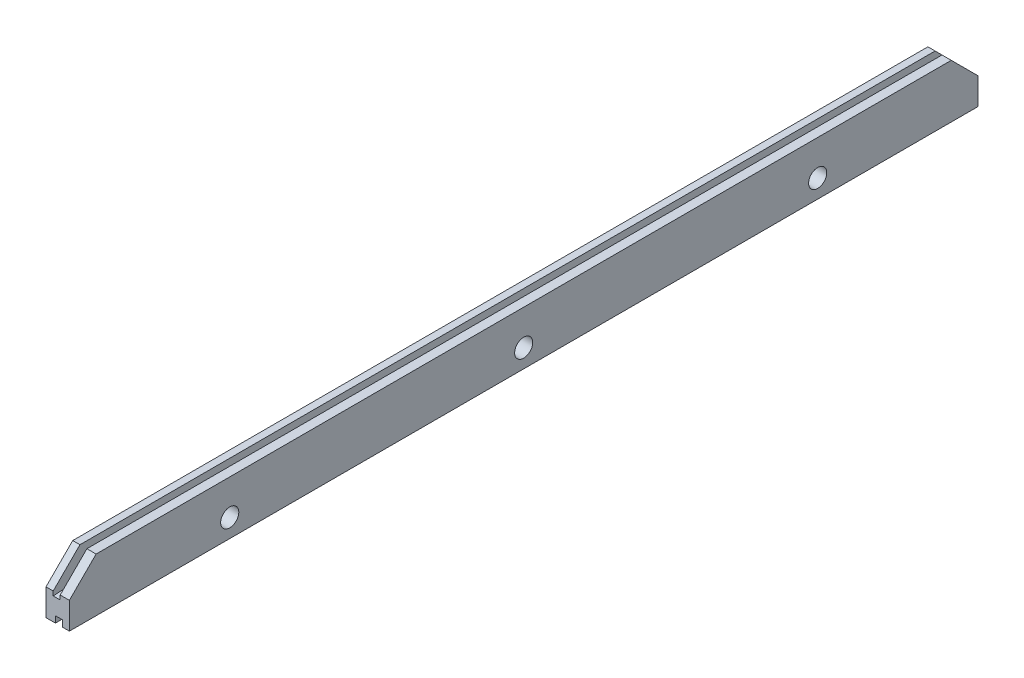
ISO-10303-21;
HEADER;
FILE_DESCRIPTION(('STEP AP214'),'2;1');
FILE_NAME('part.step','',(''),(''),'','','');
FILE_SCHEMA(('AUTOMOTIVE_DESIGN { 1 0 10303 214 1 1 1 1 }'));
ENDSEC;
DATA;
#1=APPLICATION_CONTEXT('core data for automotive mechanical design processes');
#2=APPLICATION_PROTOCOL_DEFINITION('international standard','automotive_design',2000,#1);
#3=PRODUCT_CONTEXT('',#1,'mechanical');
#4=PRODUCT('Part','Part','',(#3));
#5=PRODUCT_RELATED_PRODUCT_CATEGORY('part','',(#4));
#6=PRODUCT_DEFINITION_FORMATION('','',#4);
#7=PRODUCT_DEFINITION_CONTEXT('part definition',#1,'design');
#8=PRODUCT_DEFINITION('design','',#6,#7);
#9=PRODUCT_DEFINITION_SHAPE('','',#8);
#10=(LENGTH_UNIT() NAMED_UNIT(*) SI_UNIT(.MILLI.,.METRE.));
#11=(NAMED_UNIT(*) PLANE_ANGLE_UNIT() SI_UNIT($,.RADIAN.));
#12=(NAMED_UNIT(*) SI_UNIT($,.STERADIAN.) SOLID_ANGLE_UNIT());
#13=UNCERTAINTY_MEASURE_WITH_UNIT(LENGTH_MEASURE(1.E-05),#10,'distance_accuracy_value','');
#14=(GEOMETRIC_REPRESENTATION_CONTEXT(3) GLOBAL_UNCERTAINTY_ASSIGNED_CONTEXT((#13)) GLOBAL_UNIT_ASSIGNED_CONTEXT((#10,
#11,#12)) REPRESENTATION_CONTEXT('',''));
#15=CARTESIAN_POINT('',(0.,0.,0.));
#16=DIRECTION('',(0.,0.,1.));
#17=DIRECTION('',(1.,0.,0.));
#18=AXIS2_PLACEMENT_3D('',#15,#16,#17);
#19=CARTESIAN_POINT('',(0.,-4.7625,107.95));
#20=DIRECTION('',(0.,1.,0.));
#21=DIRECTION('',(0.,0.,1.));
#22=AXIS2_PLACEMENT_3D('',#19,#20,#21);
#23=PLANE('',#22);
#24=DIRECTION('',(1.,0.,0.));
#25=VECTOR('',#24,1.);
#26=CARTESIAN_POINT('',(0.,-4.7625,-107.95));
#27=LINE('',#26,#25);
#28=CARTESIAN_POINT('',(0.,-4.7625,-107.95));
#29=VERTEX_POINT('',#28);
#30=CARTESIAN_POINT('',(2.23519999999999,-4.7625,-107.95));
#31=VERTEX_POINT('',#30);
#32=EDGE_CURVE('E184',#29,#31,#27,.T.);
#33=ORIENTED_EDGE('',*,*,#32,.T.);
#34=DIRECTION('',(0.,0.,1.));
#35=VECTOR('',#34,1.);
#36=CARTESIAN_POINT('',(2.23519999999999,-4.7625,-107.95));
#37=LINE('',#36,#35);
#38=CARTESIAN_POINT('',(2.23519999999999,-4.7625,107.95));
#39=VERTEX_POINT('',#38);
#40=EDGE_CURVE('E165',#31,#39,#37,.T.);
#41=ORIENTED_EDGE('',*,*,#40,.T.);
#42=DIRECTION('',(1.,0.,0.));
#43=VECTOR('',#42,1.);
#44=CARTESIAN_POINT('',(0.,-4.7625,107.95));
#45=LINE('',#44,#43);
#46=CARTESIAN_POINT('',(0.,-4.7625,107.95));
#47=VERTEX_POINT('',#46);
#48=EDGE_CURVE('E318',#47,#39,#45,.T.);
#49=ORIENTED_EDGE('',*,*,#48,.F.);
#50=DIRECTION('',(0.,0.,-1.));
#51=VECTOR('',#50,1.);
#52=CARTESIAN_POINT('',(0.,-4.7625,107.95));
#53=LINE('',#52,#51);
#54=EDGE_CURVE('E192',#47,#29,#53,.T.);
#55=ORIENTED_EDGE('',*,*,#54,.T.);
#56=EDGE_LOOP('',(#33,#41,#49,#55));
#57=FACE_BOUND('',#56,.T.);
#58=ADVANCED_FACE('F40',(#57),#23,.F.);
#59=CARTESIAN_POINT('',(0.,4.7625,107.95));
#60=DIRECTION('',(1.,0.,0.));
#61=DIRECTION('',(0.,0.,-1.));
#62=AXIS2_PLACEMENT_3D('',#59,#60,#61);
#63=PLANE('',#62);
#64=CARTESIAN_POINT('',(0.,-0.396874999999998,69.85));
#65=DIRECTION('',(-1.,0.,0.));
#66=DIRECTION('',(0.,0.,1.));
#67=AXIS2_PLACEMENT_3D('',#64,#65,#66);
#68=CIRCLE('',#67,2.15265);
#69=CARTESIAN_POINT('',(0.,-0.396874999999998,72.00265));
#70=VERTEX_POINT('',#69);
#71=EDGE_CURVE('E390',#70,#70,#68,.T.);
#72=ORIENTED_EDGE('',*,*,#71,.F.);
#73=EDGE_LOOP('',(#72));
#74=FACE_BOUND('',#73,.T.);
#75=CARTESIAN_POINT('',(0.,-0.396874999999998,-69.85));
#76=DIRECTION('',(-1.,0.,0.));
#77=DIRECTION('',(0.,0.,1.));
#78=AXIS2_PLACEMENT_3D('',#75,#76,#77);
#79=CIRCLE('',#78,2.15265);
#80=CARTESIAN_POINT('',(0.,-0.396874999999998,-67.69735));
#81=VERTEX_POINT('',#80);
#82=EDGE_CURVE('E382',#81,#81,#79,.T.);
#83=ORIENTED_EDGE('',*,*,#82,.F.);
#84=EDGE_LOOP('',(#83));
#85=FACE_BOUND('',#84,.T.);
#86=CARTESIAN_POINT('',(0.,-0.396874999999998,0.));
#87=DIRECTION('',(-1.,0.,0.));
#88=DIRECTION('',(0.,0.,1.));
#89=AXIS2_PLACEMENT_3D('',#86,#87,#88);
#90=CIRCLE('',#89,2.15265);
#91=CARTESIAN_POINT('',(0.,-0.396874999999998,2.15265));
#92=VERTEX_POINT('',#91);
#93=EDGE_CURVE('E374',#92,#92,#90,.T.);
#94=ORIENTED_EDGE('',*,*,#93,.F.);
#95=EDGE_LOOP('',(#94));
#96=FACE_BOUND('',#95,.T.);
#97=DIRECTION('',(0.,0.,1.));
#98=VECTOR('',#97,1.);
#99=CARTESIAN_POINT('',(0.,7.9375,-107.95));
#100=LINE('',#99,#98);
#101=CARTESIAN_POINT('',(0.,7.9375,-101.6));
#102=VERTEX_POINT('',#101);
#103=CARTESIAN_POINT('',(0.,7.9375,101.6));
#104=VERTEX_POINT('',#103);
#105=EDGE_CURVE('E398',#102,#104,#100,.T.);
#106=ORIENTED_EDGE('',*,*,#105,.F.);
#107=DIRECTION('',(0.,-0.707106781186549,-0.707106781186546));
#108=VECTOR('',#107,1.);
#109=CARTESIAN_POINT('',(0.,7.9375,-101.6));
#110=LINE('',#109,#108);
#111=CARTESIAN_POINT('',(0.,1.58749999999998,-107.95));
#112=VERTEX_POINT('',#111);
#113=EDGE_CURVE('E255',#102,#112,#110,.T.);
#114=ORIENTED_EDGE('',*,*,#113,.T.);
#115=DIRECTION('',(0.,-1.,0.));
#116=VECTOR('',#115,1.);
#117=CARTESIAN_POINT('',(0.,4.7625,-107.95));
#118=LINE('',#117,#116);
#119=EDGE_CURVE('E203',#112,#29,#118,.T.);
#120=ORIENTED_EDGE('',*,*,#119,.T.);
#121=ORIENTED_EDGE('',*,*,#54,.F.);
#122=DIRECTION('',(0.,-1.,0.));
#123=VECTOR('',#122,1.);
#124=CARTESIAN_POINT('',(0.,4.7625,107.95));
#125=LINE('',#124,#123);
#126=CARTESIAN_POINT('',(0.,1.58749999999998,107.95));
#127=VERTEX_POINT('',#126);
#128=EDGE_CURVE('E201',#127,#47,#125,.T.);
#129=ORIENTED_EDGE('',*,*,#128,.F.);
#130=DIRECTION('',(0.,-0.707106781186549,0.707106781186546));
#131=VECTOR('',#130,1.);
#132=CARTESIAN_POINT('',(0.,7.9375,101.6));
#133=LINE('',#132,#131);
#134=EDGE_CURVE('E252',#127,#104,#133,.F.);
#135=ORIENTED_EDGE('',*,*,#134,.T.);
#136=EDGE_LOOP('',(#106,#114,#120,#121,#129,#135));
#137=FACE_BOUND('',#136,.T.);
#138=ADVANCED_FACE('F448',(#74,#85,#96,#137),#63,.F.);
#139=CARTESIAN_POINT('',(3.88619999999999,-4.7625,107.95));
#140=VERTEX_POINT('',#139);
#141=CARTESIAN_POINT('',(5.55625,-4.7625,107.95));
#142=VERTEX_POINT('',#141);
#143=EDGE_CURVE('E321',#140,#142,#45,.T.);
#144=ORIENTED_EDGE('',*,*,#143,.F.);
#145=DIRECTION('',(0.,0.,1.));
#146=VECTOR('',#145,1.);
#147=CARTESIAN_POINT('',(3.88619999999999,-4.7625,-107.95));
#148=LINE('',#147,#146);
#149=CARTESIAN_POINT('',(3.88619999999999,-4.7625,-107.95));
#150=VERTEX_POINT('',#149);
#151=EDGE_CURVE('E177',#150,#140,#148,.T.);
#152=ORIENTED_EDGE('',*,*,#151,.F.);
#153=CARTESIAN_POINT('',(5.55625,-4.7625,-107.95));
#154=VERTEX_POINT('',#153);
#155=EDGE_CURVE('E195',#150,#154,#27,.T.);
#156=ORIENTED_EDGE('',*,*,#155,.T.);
#157=DIRECTION('',(0.,0.,-1.));
#158=VECTOR('',#157,1.);
#159=CARTESIAN_POINT('',(5.55625,-4.7625,107.95));
#160=LINE('',#159,#158);
#161=EDGE_CURVE('E207',#142,#154,#160,.T.);
#162=ORIENTED_EDGE('',*,*,#161,.F.);
#163=EDGE_LOOP('',(#144,#152,#156,#162));
#164=FACE_BOUND('',#163,.T.);
#165=ADVANCED_FACE('F450',(#164),#23,.F.);
#166=CARTESIAN_POINT('',(5.55625,-4.7625,107.95));
#167=DIRECTION('',(-1.,0.,0.));
#168=DIRECTION('',(0.,0.,1.));
#169=AXIS2_PLACEMENT_3D('',#166,#167,#168);
#170=PLANE('',#169);
#171=CARTESIAN_POINT('',(5.55625000000005,-0.396874999999998,69.85));
#172=DIRECTION('',(-1.,0.,0.));
#173=DIRECTION('',(0.,0.,1.));
#174=AXIS2_PLACEMENT_3D('',#171,#172,#173);
#175=CIRCLE('',#174,2.15265);
#176=CARTESIAN_POINT('',(5.55625000000005,-0.396874999999998,72.00265));
#177=VERTEX_POINT('',#176);
#178=EDGE_CURVE('E386',#177,#177,#175,.T.);
#179=ORIENTED_EDGE('',*,*,#178,.T.);
#180=EDGE_LOOP('',(#179));
#181=FACE_BOUND('',#180,.T.);
#182=CARTESIAN_POINT('',(5.55624999999994,-0.396874999999998,-69.85));
#183=DIRECTION('',(-1.,0.,0.));
#184=DIRECTION('',(0.,0.,1.));
#185=AXIS2_PLACEMENT_3D('',#182,#183,#184);
#186=CIRCLE('',#185,2.15265);
#187=CARTESIAN_POINT('',(5.55624999999994,-0.396874999999998,-67.69735));
#188=VERTEX_POINT('',#187);
#189=EDGE_CURVE('E378',#188,#188,#186,.T.);
#190=ORIENTED_EDGE('',*,*,#189,.T.);
#191=EDGE_LOOP('',(#190));
#192=FACE_BOUND('',#191,.T.);
#193=CARTESIAN_POINT('',(5.55625,-0.396874999999998,0.));
#194=DIRECTION('',(-1.,0.,0.));
#195=DIRECTION('',(0.,0.,1.));
#196=AXIS2_PLACEMENT_3D('',#193,#194,#195);
#197=CIRCLE('',#196,2.15265);
#198=CARTESIAN_POINT('',(5.55625,-0.396874999999998,2.15265));
#199=VERTEX_POINT('',#198);
#200=EDGE_CURVE('E366',#199,#199,#197,.T.);
#201=ORIENTED_EDGE('',*,*,#200,.T.);
#202=EDGE_LOOP('',(#201));
#203=FACE_BOUND('',#202,.T.);
#204=DIRECTION('',(0.,1.,0.));
#205=VECTOR('',#204,1.);
#206=CARTESIAN_POINT('',(5.55625,-4.7625,-107.95));
#207=LINE('',#206,#205);
#208=CARTESIAN_POINT('',(5.55625,1.58749999999998,-107.95));
#209=VERTEX_POINT('',#208);
#210=EDGE_CURVE('E194',#154,#209,#207,.T.);
#211=ORIENTED_EDGE('',*,*,#210,.T.);
#212=DIRECTION('',(0.,0.707106781186549,0.707106781186546));
#213=VECTOR('',#212,1.);
#214=CARTESIAN_POINT('',(5.55624999999994,7.9375,-101.6));
#215=LINE('',#214,#213);
#216=CARTESIAN_POINT('',(5.55624999999994,7.9375,-101.6));
#217=VERTEX_POINT('',#216);
#218=EDGE_CURVE('E286',#209,#217,#215,.T.);
#219=ORIENTED_EDGE('',*,*,#218,.T.);
#220=DIRECTION('',(0.,0.,-1.));
#221=VECTOR('',#220,1.);
#222=CARTESIAN_POINT('',(5.55625,7.9375,107.95));
#223=LINE('',#222,#221);
#224=CARTESIAN_POINT('',(5.55625000000005,7.9375,101.6));
#225=VERTEX_POINT('',#224);
#226=EDGE_CURVE('E406',#225,#217,#223,.T.);
#227=ORIENTED_EDGE('',*,*,#226,.F.);
#228=DIRECTION('',(0.,0.707106781186549,-0.707106781186546));
#229=VECTOR('',#228,1.);
#230=CARTESIAN_POINT('',(5.55625000000005,7.9375,101.6));
#231=LINE('',#230,#229);
#232=CARTESIAN_POINT('',(5.55625,1.58749999999998,107.95));
#233=VERTEX_POINT('',#232);
#234=EDGE_CURVE('E56',#225,#233,#231,.F.);
#235=ORIENTED_EDGE('',*,*,#234,.T.);
#236=DIRECTION('',(0.,1.,0.));
#237=VECTOR('',#236,1.);
#238=CARTESIAN_POINT('',(5.55625,-4.7625,107.95));
#239=LINE('',#238,#237);
#240=EDGE_CURVE('E211',#142,#233,#239,.T.);
#241=ORIENTED_EDGE('',*,*,#240,.F.);
#242=ORIENTED_EDGE('',*,*,#161,.T.);
#243=EDGE_LOOP('',(#211,#219,#227,#235,#241,#242));
#244=FACE_BOUND('',#243,.T.);
#245=ADVANCED_FACE('F458',(#181,#192,#203,#244),#170,.F.);
#246=CARTESIAN_POINT('',(0.,0.,107.95));
#247=DIRECTION('',(0.,0.,1.));
#248=DIRECTION('',(1.,0.,0.));
#249=AXIS2_PLACEMENT_3D('',#246,#247,#248);
#250=PLANE('',#249);
#251=DIRECTION('',(0.,-1.,0.));
#252=VECTOR('',#251,1.);
#253=CARTESIAN_POINT('',(1.71449999999999,4.7625,107.95));
#254=LINE('',#253,#252);
#255=CARTESIAN_POINT('',(1.71449999999999,1.58749999999998,107.95));
#256=VERTEX_POINT('',#255);
#257=CARTESIAN_POINT('',(1.71449999999999,0.571500000000003,107.95));
#258=VERTEX_POINT('',#257);
#259=EDGE_CURVE('E341',#256,#258,#254,.T.);
#260=ORIENTED_EDGE('',*,*,#259,.F.);
#261=DIRECTION('',(-1.,0.,0.));
#262=VECTOR('',#261,1.);
#263=CARTESIAN_POINT('',(0.,1.58749999999998,107.95));
#264=LINE('',#263,#262);
#265=EDGE_CURVE('E11',#256,#127,#264,.T.);
#266=ORIENTED_EDGE('',*,*,#265,.T.);
#267=ORIENTED_EDGE('',*,*,#128,.T.);
#268=ORIENTED_EDGE('',*,*,#48,.T.);
#269=DIRECTION('',(0.,-1.,0.));
#270=VECTOR('',#269,1.);
#271=CARTESIAN_POINT('',(2.23519999999999,-4.7625,107.95));
#272=LINE('',#271,#270);
#273=CARTESIAN_POINT('',(2.23519999999999,-3.2385,107.95));
#274=VERTEX_POINT('',#273);
#275=EDGE_CURVE('E171',#274,#39,#272,.T.);
#276=ORIENTED_EDGE('',*,*,#275,.F.);
#277=DIRECTION('',(-1.,0.,0.));
#278=VECTOR('',#277,1.);
#279=CARTESIAN_POINT('',(2.23519999999999,-3.2385,107.95));
#280=LINE('',#279,#278);
#281=CARTESIAN_POINT('',(3.88619999999999,-3.2385,107.95));
#282=VERTEX_POINT('',#281);
#283=EDGE_CURVE('E188',#282,#274,#280,.T.);
#284=ORIENTED_EDGE('',*,*,#283,.F.);
#285=DIRECTION('',(0.,1.,0.));
#286=VECTOR('',#285,1.);
#287=CARTESIAN_POINT('',(3.88619999999999,-4.7625,107.95));
#288=LINE('',#287,#286);
#289=EDGE_CURVE('E360',#140,#282,#288,.T.);
#290=ORIENTED_EDGE('',*,*,#289,.F.);
#291=ORIENTED_EDGE('',*,*,#143,.T.);
#292=ORIENTED_EDGE('',*,*,#240,.T.);
#293=DIRECTION('',(-1.,0.,0.));
#294=VECTOR('',#293,1.);
#295=CARTESIAN_POINT('',(0.,1.58749999999998,107.95));
#296=LINE('',#295,#294);
#297=CARTESIAN_POINT('',(3.36549999999999,1.58749999999998,107.95));
#298=VERTEX_POINT('',#297);
#299=EDGE_CURVE('E49',#233,#298,#296,.T.);
#300=ORIENTED_EDGE('',*,*,#299,.T.);
#301=DIRECTION('',(0.,1.,0.));
#302=VECTOR('',#301,1.);
#303=CARTESIAN_POINT('',(3.36549999999999,4.7625,107.95));
#304=LINE('',#303,#302);
#305=CARTESIAN_POINT('',(3.36549999999999,0.571500000000003,107.95));
#306=VERTEX_POINT('',#305);
#307=EDGE_CURVE('E337',#306,#298,#304,.T.);
#308=ORIENTED_EDGE('',*,*,#307,.F.);
#309=DIRECTION('',(-1.,0.,0.));
#310=VECTOR('',#309,1.);
#311=CARTESIAN_POINT('',(1.71449999999999,0.571500000000003,107.95));
#312=LINE('',#311,#310);
#313=EDGE_CURVE('E218',#306,#258,#312,.T.);
#314=ORIENTED_EDGE('',*,*,#313,.T.);
#315=EDGE_LOOP('',(#260,#266,#267,#268,#276,#284,#290,#291,#292,#300,#308,#314));
#316=FACE_BOUND('',#315,.T.);
#317=ADVANCED_FACE('F463',(#316),#250,.T.);
#318=CARTESIAN_POINT('',(0.,0.,-107.95));
#319=DIRECTION('',(0.,0.,1.));
#320=DIRECTION('',(1.,0.,0.));
#321=AXIS2_PLACEMENT_3D('',#318,#319,#320);
#322=PLANE('',#321);
#323=ORIENTED_EDGE('',*,*,#119,.F.);
#324=DIRECTION('',(1.,0.,0.));
#325=VECTOR('',#324,1.);
#326=CARTESIAN_POINT('',(1.71449999999999,1.58749999999998,-107.95));
#327=LINE('',#326,#325);
#328=CARTESIAN_POINT('',(1.71449999999999,1.58749999999998,-107.95));
#329=VERTEX_POINT('',#328);
#330=EDGE_CURVE('E261',#112,#329,#327,.T.);
#331=ORIENTED_EDGE('',*,*,#330,.T.);
#332=DIRECTION('',(0.,-1.,0.));
#333=VECTOR('',#332,1.);
#334=CARTESIAN_POINT('',(1.71449999999999,4.7625,-107.95));
#335=LINE('',#334,#333);
#336=CARTESIAN_POINT('',(1.71449999999999,0.571500000000003,-107.95));
#337=VERTEX_POINT('',#336);
#338=EDGE_CURVE('E340',#329,#337,#335,.T.);
#339=ORIENTED_EDGE('',*,*,#338,.T.);
#340=DIRECTION('',(1.,0.,0.));
#341=VECTOR('',#340,1.);
#342=CARTESIAN_POINT('',(0.,0.571500000000003,-107.95));
#343=LINE('',#342,#341);
#344=CARTESIAN_POINT('',(3.36549999999999,0.571500000000003,-107.95));
#345=VERTEX_POINT('',#344);
#346=EDGE_CURVE('E230',#337,#345,#343,.T.);
#347=ORIENTED_EDGE('',*,*,#346,.T.);
#348=DIRECTION('',(0.,1.,0.));
#349=VECTOR('',#348,1.);
#350=CARTESIAN_POINT('',(3.36549999999999,4.7625,-107.95));
#351=LINE('',#350,#349);
#352=CARTESIAN_POINT('',(3.36549999999999,1.58749999999998,-107.95));
#353=VERTEX_POINT('',#352);
#354=EDGE_CURVE('E334',#345,#353,#351,.T.);
#355=ORIENTED_EDGE('',*,*,#354,.T.);
#356=DIRECTION('',(1.,0.,0.));
#357=VECTOR('',#356,1.);
#358=CARTESIAN_POINT('',(5.55625,1.58749999999998,-107.95));
#359=LINE('',#358,#357);
#360=EDGE_CURVE('E258',#353,#209,#359,.T.);
#361=ORIENTED_EDGE('',*,*,#360,.T.);
#362=ORIENTED_EDGE('',*,*,#210,.F.);
#363=ORIENTED_EDGE('',*,*,#155,.F.);
#364=DIRECTION('',(0.,1.,0.));
#365=VECTOR('',#364,1.);
#366=CARTESIAN_POINT('',(3.88619999999999,-4.7625,-107.95));
#367=LINE('',#366,#365);
#368=CARTESIAN_POINT('',(3.88619999999999,-3.2385,-107.95));
#369=VERTEX_POINT('',#368);
#370=EDGE_CURVE('E187',#150,#369,#367,.T.);
#371=ORIENTED_EDGE('',*,*,#370,.T.);
#372=DIRECTION('',(-1.,0.,0.));
#373=VECTOR('',#372,1.);
#374=CARTESIAN_POINT('',(2.23519999999999,-3.2385,-107.95));
#375=LINE('',#374,#373);
#376=CARTESIAN_POINT('',(2.23519999999999,-3.2385,-107.95));
#377=VERTEX_POINT('',#376);
#378=EDGE_CURVE('E178',#369,#377,#375,.T.);
#379=ORIENTED_EDGE('',*,*,#378,.T.);
#380=DIRECTION('',(0.,-1.,0.));
#381=VECTOR('',#380,1.);
#382=CARTESIAN_POINT('',(2.23519999999999,-4.7625,-107.95));
#383=LINE('',#382,#381);
#384=EDGE_CURVE('E168',#377,#31,#383,.T.);
#385=ORIENTED_EDGE('',*,*,#384,.T.);
#386=ORIENTED_EDGE('',*,*,#32,.F.);
#387=EDGE_LOOP('',(#323,#331,#339,#347,#355,#361,#362,#363,#371,#379,#385,#386));
#388=FACE_BOUND('',#387,.T.);
#389=ADVANCED_FACE('F183',(#388),#322,.F.);
#390=CARTESIAN_POINT('',(1.71449999999999,4.7625,-107.95));
#391=DIRECTION('',(-1.,0.,0.));
#392=DIRECTION('',(0.,-1.,0.));
#393=AXIS2_PLACEMENT_3D('',#390,#391,#392);
#394=PLANE('',#393);
#395=ORIENTED_EDGE('',*,*,#338,.F.);
#396=DIRECTION('',(0.,0.707106781186549,0.707106781186546));
#397=VECTOR('',#396,1.);
#398=CARTESIAN_POINT('',(1.71449999999994,7.9375,-101.6));
#399=LINE('',#398,#397);
#400=CARTESIAN_POINT('',(1.71449999999994,7.9375,-101.6));
#401=VERTEX_POINT('',#400);
#402=EDGE_CURVE('E267',#329,#401,#399,.T.);
#403=ORIENTED_EDGE('',*,*,#402,.T.);
#404=DIRECTION('',(0.,0.,-1.));
#405=VECTOR('',#404,1.);
#406=CARTESIAN_POINT('',(1.71449999999999,7.9375,107.95));
#407=LINE('',#406,#405);
#408=CARTESIAN_POINT('',(1.71450000000005,7.9375,101.6));
#409=VERTEX_POINT('',#408);
#410=EDGE_CURVE('E394',#409,#401,#407,.T.);
#411=ORIENTED_EDGE('',*,*,#410,.F.);
#412=DIRECTION('',(0.,0.707106781186549,-0.707106781186546));
#413=VECTOR('',#412,1.);
#414=CARTESIAN_POINT('',(1.71450000000005,7.9375,101.6));
#415=LINE('',#414,#413);
#416=EDGE_CURVE('E264',#409,#256,#415,.F.);
#417=ORIENTED_EDGE('',*,*,#416,.T.);
#418=ORIENTED_EDGE('',*,*,#259,.T.);
#419=DIRECTION('',(0.,0.0598922907279433,-0.998204845465779));
#420=VECTOR('',#419,1.);
#421=CARTESIAN_POINT('',(1.71449999999999,13.4940663610993,-107.426106018334));
#422=LINE('',#421,#420);
#423=CARTESIAN_POINT('',(1.71449999999999,2.0955,82.5499999999986));
#424=VERTEX_POINT('',#423);
#425=EDGE_CURVE('E226',#258,#424,#422,.T.);
#426=ORIENTED_EDGE('',*,*,#425,.T.);
#427=DIRECTION('',(0.,0.,1.));
#428=VECTOR('',#427,1.);
#429=CARTESIAN_POINT('',(1.71449999999999,2.0955,-107.95));
#430=LINE('',#429,#428);
#431=CARTESIAN_POINT('',(1.71449999999999,2.0955,-82.5499999999985));
#432=VERTEX_POINT('',#431);
#433=EDGE_CURVE('E330',#432,#424,#430,.T.);
#434=ORIENTED_EDGE('',*,*,#433,.F.);
#435=DIRECTION('',(0.,0.0598922907279432,0.998204845465779));
#436=VECTOR('',#435,1.);
#437=CARTESIAN_POINT('',(1.71449999999999,0.586533479473898,-107.699442008768));
#438=LINE('',#437,#436);
#439=EDGE_CURVE('E240',#432,#337,#438,.F.);
#440=ORIENTED_EDGE('',*,*,#439,.T.);
#441=EDGE_LOOP('',(#395,#403,#411,#417,#418,#426,#434,#440));
#442=FACE_BOUND('',#441,.T.);
#443=ADVANCED_FACE('F491',(#442),#394,.F.);
#444=CARTESIAN_POINT('',(3.36549999999999,4.7625,-107.95));
#445=DIRECTION('',(1.,0.,0.));
#446=DIRECTION('',(0.,1.,0.));
#447=AXIS2_PLACEMENT_3D('',#444,#445,#446);
#448=PLANE('',#447);
#449=DIRECTION('',(0.,0.,1.));
#450=VECTOR('',#449,1.);
#451=CARTESIAN_POINT('',(3.36549999999999,7.9375,-107.95));
#452=LINE('',#451,#450);
#453=CARTESIAN_POINT('',(3.36549999999994,7.9375,-101.6));
#454=VERTEX_POINT('',#453);
#455=CARTESIAN_POINT('',(3.36550000000005,7.9375,101.6));
#456=VERTEX_POINT('',#455);
#457=EDGE_CURVE('E402',#454,#456,#452,.T.);
#458=ORIENTED_EDGE('',*,*,#457,.F.);
#459=DIRECTION('',(0.,-0.707106781186549,-0.707106781186546));
#460=VECTOR('',#459,1.);
#461=CARTESIAN_POINT('',(3.36549999999994,7.9375,-101.6));
#462=LINE('',#461,#460);
#463=EDGE_CURVE('E281',#454,#353,#462,.T.);
#464=ORIENTED_EDGE('',*,*,#463,.T.);
#465=ORIENTED_EDGE('',*,*,#354,.F.);
#466=DIRECTION('',(0.,-0.0598922907279432,-0.998204845465779));
#467=VECTOR('',#466,1.);
#468=CARTESIAN_POINT('',(3.36549999999999,0.586533479473898,-107.699442008768));
#469=LINE('',#468,#467);
#470=CARTESIAN_POINT('',(3.36549999999999,2.0955,-82.5499999999985));
#471=VERTEX_POINT('',#470);
#472=EDGE_CURVE('E237',#345,#471,#469,.F.);
#473=ORIENTED_EDGE('',*,*,#472,.T.);
#474=DIRECTION('',(0.,0.,1.));
#475=VECTOR('',#474,1.);
#476=CARTESIAN_POINT('',(3.36549999999999,2.0955,-107.95));
#477=LINE('',#476,#475);
#478=CARTESIAN_POINT('',(3.36549999999999,2.0955,82.5499999999986));
#479=VERTEX_POINT('',#478);
#480=EDGE_CURVE('E333',#471,#479,#477,.T.);
#481=ORIENTED_EDGE('',*,*,#480,.T.);
#482=DIRECTION('',(0.,-0.0598922907279433,0.998204845465779));
#483=VECTOR('',#482,1.);
#484=CARTESIAN_POINT('',(3.36549999999999,13.4940663610993,-107.426106018334));
#485=LINE('',#484,#483);
#486=EDGE_CURVE('E222',#479,#306,#485,.T.);
#487=ORIENTED_EDGE('',*,*,#486,.T.);
#488=ORIENTED_EDGE('',*,*,#307,.T.);
#489=DIRECTION('',(0.,-0.707106781186549,0.707106781186546));
#490=VECTOR('',#489,1.);
#491=CARTESIAN_POINT('',(3.36550000000005,7.9375,101.6));
#492=LINE('',#491,#490);
#493=EDGE_CURVE('E278',#298,#456,#492,.F.);
#494=ORIENTED_EDGE('',*,*,#493,.T.);
#495=EDGE_LOOP('',(#458,#464,#465,#473,#481,#487,#488,#494));
#496=FACE_BOUND('',#495,.T.);
#497=ADVANCED_FACE('F420',(#496),#448,.F.);
#498=CARTESIAN_POINT('',(1.71449999999999,2.0955,-107.95));
#499=DIRECTION('',(0.,-1.,0.));
#500=DIRECTION('',(0.,0.,-1.));
#501=AXIS2_PLACEMENT_3D('',#498,#499,#500);
#502=PLANE('',#501);
#503=ORIENTED_EDGE('',*,*,#480,.F.);
#504=DIRECTION('',(-1.,0.,0.));
#505=VECTOR('',#504,1.);
#506=CARTESIAN_POINT('',(1.71449999999999,2.0955,-82.5499999999985));
#507=LINE('',#506,#505);
#508=EDGE_CURVE('E234',#471,#432,#507,.T.);
#509=ORIENTED_EDGE('',*,*,#508,.T.);
#510=ORIENTED_EDGE('',*,*,#433,.T.);
#511=DIRECTION('',(1.,0.,0.));
#512=VECTOR('',#511,1.);
#513=CARTESIAN_POINT('',(3.36549999999999,2.0955,82.5499999999986));
#514=LINE('',#513,#512);
#515=EDGE_CURVE('E214',#424,#479,#514,.T.);
#516=ORIENTED_EDGE('',*,*,#515,.T.);
#517=EDGE_LOOP('',(#503,#509,#510,#516));
#518=FACE_BOUND('',#517,.T.);
#519=ADVANCED_FACE('F432',(#518),#502,.F.);
#520=CARTESIAN_POINT('',(2.23519999999999,-4.7625,-107.95));
#521=DIRECTION('',(-1.,0.,0.));
#522=DIRECTION('',(0.,0.,1.));
#523=AXIS2_PLACEMENT_3D('',#520,#521,#522);
#524=PLANE('',#523);
#525=ORIENTED_EDGE('',*,*,#275,.T.);
#526=ORIENTED_EDGE('',*,*,#40,.F.);
#527=ORIENTED_EDGE('',*,*,#384,.F.);
#528=DIRECTION('',(0.,0.,1.));
#529=VECTOR('',#528,1.);
#530=CARTESIAN_POINT('',(2.23519999999999,-3.2385,-107.95));
#531=LINE('',#530,#529);
#532=EDGE_CURVE('E344',#377,#274,#531,.T.);
#533=ORIENTED_EDGE('',*,*,#532,.T.);
#534=EDGE_LOOP('',(#525,#526,#527,#533));
#535=FACE_BOUND('',#534,.T.);
#536=ADVANCED_FACE('F167',(#535),#524,.F.);
#537=CARTESIAN_POINT('',(2.23519999999999,-3.2385,-107.95));
#538=DIRECTION('',(0.,1.,0.));
#539=DIRECTION('',(-1.,0.,0.));
#540=AXIS2_PLACEMENT_3D('',#537,#538,#539);
#541=PLANE('',#540);
#542=ORIENTED_EDGE('',*,*,#283,.T.);
#543=ORIENTED_EDGE('',*,*,#532,.F.);
#544=ORIENTED_EDGE('',*,*,#378,.F.);
#545=DIRECTION('',(0.,0.,1.));
#546=VECTOR('',#545,1.);
#547=CARTESIAN_POINT('',(3.88619999999999,-3.2385,-107.95));
#548=LINE('',#547,#546);
#549=EDGE_CURVE('E352',#369,#282,#548,.T.);
#550=ORIENTED_EDGE('',*,*,#549,.T.);
#551=EDGE_LOOP('',(#542,#543,#544,#550));
#552=FACE_BOUND('',#551,.T.);
#553=ADVANCED_FACE('F476',(#552),#541,.F.);
#554=CARTESIAN_POINT('',(3.88619999999999,-4.7625,-107.95));
#555=DIRECTION('',(1.,0.,0.));
#556=DIRECTION('',(0.,0.,-1.));
#557=AXIS2_PLACEMENT_3D('',#554,#555,#556);
#558=PLANE('',#557);
#559=ORIENTED_EDGE('',*,*,#289,.T.);
#560=ORIENTED_EDGE('',*,*,#549,.F.);
#561=ORIENTED_EDGE('',*,*,#370,.F.);
#562=ORIENTED_EDGE('',*,*,#151,.T.);
#563=EDGE_LOOP('',(#559,#560,#561,#562));
#564=FACE_BOUND('',#563,.T.);
#565=ADVANCED_FACE('F474',(#564),#558,.F.);
#566=CARTESIAN_POINT('',(0.,-0.396874999999998,0.));
#567=DIRECTION('',(-1.,0.,0.));
#568=DIRECTION('',(0.,0.,1.));
#569=AXIS2_PLACEMENT_3D('',#566,#567,#568);
#570=CYLINDRICAL_SURFACE('',#569,2.15265);
#571=ORIENTED_EDGE('',*,*,#200,.F.);
#572=EDGE_LOOP('',(#571));
#573=FACE_BOUND('',#572,.T.);
#574=ORIENTED_EDGE('',*,*,#93,.T.);
#575=EDGE_LOOP('',(#574));
#576=FACE_BOUND('',#575,.T.);
#577=ADVANCED_FACE('F483',(#573,#576),#570,.F.);
#578=CARTESIAN_POINT('',(0.,-0.396874999999998,-69.85));
#579=DIRECTION('',(-1.,0.,0.));
#580=DIRECTION('',(0.,0.,1.));
#581=AXIS2_PLACEMENT_3D('',#578,#579,#580);
#582=CYLINDRICAL_SURFACE('',#581,2.15265);
#583=ORIENTED_EDGE('',*,*,#189,.F.);
#584=EDGE_LOOP('',(#583));
#585=FACE_BOUND('',#584,.T.);
#586=ORIENTED_EDGE('',*,*,#82,.T.);
#587=EDGE_LOOP('',(#586));
#588=FACE_BOUND('',#587,.T.);
#589=ADVANCED_FACE('F541',(#585,#588),#582,.F.);
#590=CARTESIAN_POINT('',(0.,-0.396874999999998,69.85));
#591=DIRECTION('',(-1.,0.,0.));
#592=DIRECTION('',(0.,0.,1.));
#593=AXIS2_PLACEMENT_3D('',#590,#591,#592);
#594=CYLINDRICAL_SURFACE('',#593,2.15265);
#595=ORIENTED_EDGE('',*,*,#178,.F.);
#596=EDGE_LOOP('',(#595));
#597=FACE_BOUND('',#596,.T.);
#598=ORIENTED_EDGE('',*,*,#71,.T.);
#599=EDGE_LOOP('',(#598));
#600=FACE_BOUND('',#599,.T.);
#601=ADVANCED_FACE('F550',(#597,#600),#594,.F.);
#602=CARTESIAN_POINT('',(1.71449999999999,2.0955,82.5499999999986));
#603=DIRECTION('',(0.,0.998204845465779,0.0598922907279433));
#604=DIRECTION('',(-1.,0.,0.));
#605=AXIS2_PLACEMENT_3D('',#602,#603,#604);
#606=PLANE('',#605);
#607=ORIENTED_EDGE('',*,*,#425,.F.);
#608=ORIENTED_EDGE('',*,*,#313,.F.);
#609=ORIENTED_EDGE('',*,*,#486,.F.);
#610=ORIENTED_EDGE('',*,*,#515,.F.);
#611=EDGE_LOOP('',(#607,#608,#609,#610));
#612=FACE_BOUND('',#611,.T.);
#613=ADVANCED_FACE('F437',(#612),#606,.T.);
#614=CARTESIAN_POINT('',(0.,0.571500000000003,-107.95));
#615=DIRECTION('',(0.,-0.998204845465779,0.0598922907279432));
#616=DIRECTION('',(1.,0.,0.));
#617=AXIS2_PLACEMENT_3D('',#614,#615,#616);
#618=PLANE('',#617);
#619=ORIENTED_EDGE('',*,*,#439,.F.);
#620=ORIENTED_EDGE('',*,*,#508,.F.);
#621=ORIENTED_EDGE('',*,*,#472,.F.);
#622=ORIENTED_EDGE('',*,*,#346,.F.);
#623=EDGE_LOOP('',(#619,#620,#621,#622));
#624=FACE_BOUND('',#623,.T.);
#625=ADVANCED_FACE('F427',(#624),#618,.F.);
#626=CARTESIAN_POINT('',(0.,7.9375,0.));
#627=DIRECTION('',(0.,1.,0.));
#628=DIRECTION('',(0.,0.,1.));
#629=AXIS2_PLACEMENT_3D('',#626,#627,#628);
#630=PLANE('',#629);
#631=ORIENTED_EDGE('',*,*,#410,.T.);
#632=DIRECTION('',(-1.,0.,0.));
#633=VECTOR('',#632,1.);
#634=CARTESIAN_POINT('',(0.,7.9375,-101.6));
#635=LINE('',#634,#633);
#636=EDGE_CURVE('E248',#401,#102,#635,.T.);
#637=ORIENTED_EDGE('',*,*,#636,.T.);
#638=ORIENTED_EDGE('',*,*,#105,.T.);
#639=DIRECTION('',(1.,0.,0.));
#640=VECTOR('',#639,1.);
#641=CARTESIAN_POINT('',(0.,7.9375,101.6));
#642=LINE('',#641,#640);
#643=EDGE_CURVE('E244',#104,#409,#642,.T.);
#644=ORIENTED_EDGE('',*,*,#643,.T.);
#645=EDGE_LOOP('',(#631,#637,#638,#644));
#646=FACE_BOUND('',#645,.T.);
#647=ADVANCED_FACE('F575',(#646),#630,.T.);
#648=CARTESIAN_POINT('',(0.,7.9375,0.));
#649=DIRECTION('',(0.,1.,0.));
#650=DIRECTION('',(0.,0.,1.));
#651=AXIS2_PLACEMENT_3D('',#648,#649,#650);
#652=PLANE('',#651);
#653=ORIENTED_EDGE('',*,*,#226,.T.);
#654=DIRECTION('',(-1.,0.,0.));
#655=VECTOR('',#654,1.);
#656=CARTESIAN_POINT('',(3.36549999999994,7.9375,-101.6));
#657=LINE('',#656,#655);
#658=EDGE_CURVE('E274',#217,#454,#657,.T.);
#659=ORIENTED_EDGE('',*,*,#658,.T.);
#660=ORIENTED_EDGE('',*,*,#457,.T.);
#661=DIRECTION('',(1.,0.,0.));
#662=VECTOR('',#661,1.);
#663=CARTESIAN_POINT('',(0.,7.9375,101.6));
#664=LINE('',#663,#662);
#665=EDGE_CURVE('E270',#456,#225,#664,.T.);
#666=ORIENTED_EDGE('',*,*,#665,.T.);
#667=EDGE_LOOP('',(#653,#659,#660,#666));
#668=FACE_BOUND('',#667,.T.);
#669=ADVANCED_FACE('F412',(#668),#652,.T.);
#670=CARTESIAN_POINT('',(0.,7.9375,-101.6));
#671=DIRECTION('',(0.,0.707106781186546,-0.707106781186549));
#672=DIRECTION('',(1.,0.,0.));
#673=AXIS2_PLACEMENT_3D('',#670,#671,#672);
#674=PLANE('',#673);
#675=ORIENTED_EDGE('',*,*,#402,.F.);
#676=ORIENTED_EDGE('',*,*,#330,.F.);
#677=ORIENTED_EDGE('',*,*,#113,.F.);
#678=ORIENTED_EDGE('',*,*,#636,.F.);
#679=EDGE_LOOP('',(#675,#676,#677,#678));
#680=FACE_BOUND('',#679,.T.);
#681=ADVANCED_FACE('F594',(#680),#674,.T.);
#682=CARTESIAN_POINT('',(0.,7.9375,-101.6));
#683=DIRECTION('',(0.,0.707106781186546,-0.707106781186549));
#684=DIRECTION('',(1.,0.,0.));
#685=AXIS2_PLACEMENT_3D('',#682,#683,#684);
#686=PLANE('',#685);
#687=ORIENTED_EDGE('',*,*,#218,.F.);
#688=ORIENTED_EDGE('',*,*,#360,.F.);
#689=ORIENTED_EDGE('',*,*,#463,.F.);
#690=ORIENTED_EDGE('',*,*,#658,.F.);
#691=EDGE_LOOP('',(#687,#688,#689,#690));
#692=FACE_BOUND('',#691,.T.);
#693=ADVANCED_FACE('F417',(#692),#686,.T.);
#694=CARTESIAN_POINT('',(0.,7.9375,101.6));
#695=DIRECTION('',(0.,-0.707106781186546,-0.707106781186549));
#696=DIRECTION('',(1.,0.,0.));
#697=AXIS2_PLACEMENT_3D('',#694,#695,#696);
#698=PLANE('',#697);
#699=ORIENTED_EDGE('',*,*,#134,.F.);
#700=ORIENTED_EDGE('',*,*,#265,.F.);
#701=ORIENTED_EDGE('',*,*,#416,.F.);
#702=ORIENTED_EDGE('',*,*,#643,.F.);
#703=EDGE_LOOP('',(#699,#700,#701,#702));
#704=FACE_BOUND('',#703,.T.);
#705=ADVANCED_FACE('F442',(#704),#698,.F.);
#706=CARTESIAN_POINT('',(0.,7.9375,101.6));
#707=DIRECTION('',(0.,-0.707106781186546,-0.707106781186549));
#708=DIRECTION('',(1.,0.,0.));
#709=AXIS2_PLACEMENT_3D('',#706,#707,#708);
#710=PLANE('',#709);
#711=ORIENTED_EDGE('',*,*,#493,.F.);
#712=ORIENTED_EDGE('',*,*,#299,.F.);
#713=ORIENTED_EDGE('',*,*,#234,.F.);
#714=ORIENTED_EDGE('',*,*,#665,.F.);
#715=EDGE_LOOP('',(#711,#712,#713,#714));
#716=FACE_BOUND('',#715,.T.);
#717=ADVANCED_FACE('F42',(#716),#710,.F.);
#718=CLOSED_SHELL('',(#58,#138,#165,#245,#317,#389,#443,#497,#519,#536,#553,#565,#577,#589,#601,
#613,#625,#647,#669,#681,#693,#705,#717));
#719=MANIFOLD_SOLID_BREP('B2',#718);
#720=ADVANCED_BREP_SHAPE_REPRESENTATION('',(#18,#719),#14);
#721=SHAPE_DEFINITION_REPRESENTATION(#9,#720);
ENDSEC;
END-ISO-10303-21;
